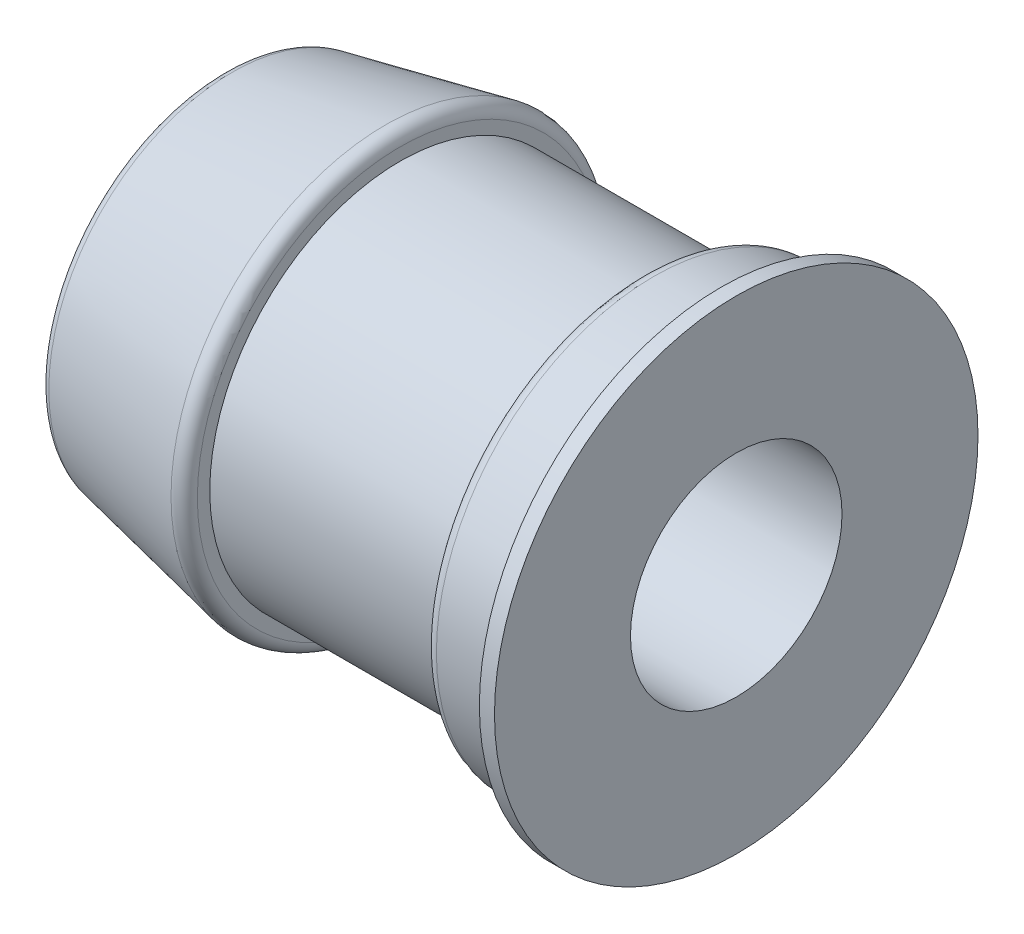
ISO-10303-21;
HEADER;
FILE_DESCRIPTION(('STEP AP214'),'2;1');
FILE_NAME('part.step','',(''),(''),'','','');
FILE_SCHEMA(('AUTOMOTIVE_DESIGN { 1 0 10303 214 1 1 1 1 }'));
ENDSEC;
DATA;
#1=APPLICATION_CONTEXT('core data for automotive mechanical design processes');
#2=APPLICATION_PROTOCOL_DEFINITION('international standard','automotive_design',2000,#1);
#3=PRODUCT_CONTEXT('',#1,'mechanical');
#4=PRODUCT('Part','Part','',(#3));
#5=PRODUCT_RELATED_PRODUCT_CATEGORY('part','',(#4));
#6=PRODUCT_DEFINITION_FORMATION('','',#4);
#7=PRODUCT_DEFINITION_CONTEXT('part definition',#1,'design');
#8=PRODUCT_DEFINITION('design','',#6,#7);
#9=PRODUCT_DEFINITION_SHAPE('','',#8);
#10=(LENGTH_UNIT() NAMED_UNIT(*) SI_UNIT(.MILLI.,.METRE.));
#11=(NAMED_UNIT(*) PLANE_ANGLE_UNIT() SI_UNIT($,.RADIAN.));
#12=(NAMED_UNIT(*) SI_UNIT($,.STERADIAN.) SOLID_ANGLE_UNIT());
#13=UNCERTAINTY_MEASURE_WITH_UNIT(LENGTH_MEASURE(1.E-05),#10,'distance_accuracy_value','');
#14=(GEOMETRIC_REPRESENTATION_CONTEXT(3) GLOBAL_UNCERTAINTY_ASSIGNED_CONTEXT((#13)) GLOBAL_UNIT_ASSIGNED_CONTEXT((#10,
#11,#12)) REPRESENTATION_CONTEXT('',''));
#15=CARTESIAN_POINT('',(0.,0.,0.));
#16=DIRECTION('',(0.,0.,1.));
#17=DIRECTION('',(1.,0.,0.));
#18=AXIS2_PLACEMENT_3D('',#15,#16,#17);
#19=CARTESIAN_POINT('',(0.,15.875,0.));
#20=DIRECTION('',(1.,0.,0.));
#21=DIRECTION('',(0.,0.,-1.));
#22=AXIS2_PLACEMENT_3D('',#19,#20,#21);
#23=PLANE('',#22);
#24=CARTESIAN_POINT('',(0.,0.,0.));
#25=DIRECTION('',(-1.,0.,0.));
#26=DIRECTION('',(0.,0.,1.));
#27=AXIS2_PLACEMENT_3D('',#24,#25,#26);
#28=CIRCLE('',#27,11.1125);
#29=CARTESIAN_POINT('',(0.,0.,11.1125));
#30=VERTEX_POINT('',#29);
#31=EDGE_CURVE('E60',#30,#30,#28,.T.);
#32=ORIENTED_EDGE('',*,*,#31,.F.);
#33=EDGE_LOOP('',(#32));
#34=FACE_BOUND('',#33,.T.);
#35=CARTESIAN_POINT('',(0.,0.,0.));
#36=DIRECTION('',(-1.,0.,0.));
#37=DIRECTION('',(0.,0.,1.));
#38=AXIS2_PLACEMENT_3D('',#35,#36,#37);
#39=CIRCLE('',#38,15.875);
#40=CARTESIAN_POINT('',(0.,0.,15.875));
#41=VERTEX_POINT('',#40);
#42=EDGE_CURVE('E84',#41,#41,#39,.T.);
#43=ORIENTED_EDGE('',*,*,#42,.T.);
#44=EDGE_LOOP('',(#43));
#45=FACE_BOUND('',#44,.T.);
#46=ADVANCED_FACE('F34',(#34,#45),#23,.F.);
#47=CARTESIAN_POINT('',(-42.2010183631773,0.,0.));
#48=DIRECTION('',(-1.,0.,0.));
#49=DIRECTION('',(0.,0.,1.));
#50=AXIS2_PLACEMENT_3D('',#47,#48,#49);
#51=CYLINDRICAL_SURFACE('',#50,11.1125);
#52=CARTESIAN_POINT('',(22.6123864777647,0.,0.));
#53=DIRECTION('',(-1.,0.,0.));
#54=DIRECTION('',(0.,0.,1.));
#55=AXIS2_PLACEMENT_3D('',#52,#53,#54);
#56=CIRCLE('',#55,11.1125);
#57=CARTESIAN_POINT('',(22.6123864777647,0.,11.1125));
#58=VERTEX_POINT('',#57);
#59=EDGE_CURVE('E63',#58,#58,#56,.T.);
#60=ORIENTED_EDGE('',*,*,#59,.F.);
#61=EDGE_LOOP('',(#60));
#62=FACE_BOUND('',#61,.T.);
#63=ORIENTED_EDGE('',*,*,#31,.T.);
#64=EDGE_LOOP('',(#63));
#65=FACE_BOUND('',#64,.T.);
#66=ADVANCED_FACE('F107',(#62,#65),#51,.F.);
#67=CARTESIAN_POINT('',(22.6123864777648,25.4,0.));
#68=DIRECTION('',(-1.,0.,0.));
#69=DIRECTION('',(0.,0.,1.));
#70=AXIS2_PLACEMENT_3D('',#67,#68,#69);
#71=PLANE('',#70);
#72=CARTESIAN_POINT('',(22.6123864777647,0.,0.));
#73=DIRECTION('',(-1.,0.,0.));
#74=DIRECTION('',(0.,0.,1.));
#75=AXIS2_PLACEMENT_3D('',#72,#73,#74);
#76=CIRCLE('',#75,25.4);
#77=CARTESIAN_POINT('',(22.6123864777647,0.,25.4));
#78=VERTEX_POINT('',#77);
#79=EDGE_CURVE('E66',#78,#78,#76,.T.);
#80=ORIENTED_EDGE('',*,*,#79,.F.);
#81=EDGE_LOOP('',(#80));
#82=FACE_BOUND('',#81,.T.);
#83=ORIENTED_EDGE('',*,*,#59,.T.);
#84=EDGE_LOOP('',(#83));
#85=FACE_BOUND('',#84,.T.);
#86=ADVANCED_FACE('F113',(#82,#85),#71,.F.);
#87=CARTESIAN_POINT('',(-42.2010183631773,0.,0.));
#88=DIRECTION('',(-1.,0.,0.));
#89=DIRECTION('',(0.,0.,1.));
#90=AXIS2_PLACEMENT_3D('',#87,#88,#89);
#91=CYLINDRICAL_SURFACE('',#90,25.4);
#92=CARTESIAN_POINT('',(21.0248864777648,0.,0.));
#93=DIRECTION('',(-1.,0.,0.));
#94=DIRECTION('',(0.,0.,1.));
#95=AXIS2_PLACEMENT_3D('',#92,#93,#94);
#96=CIRCLE('',#95,25.4);
#97=CARTESIAN_POINT('',(21.0248864777648,0.,25.4));
#98=VERTEX_POINT('',#97);
#99=EDGE_CURVE('E69',#98,#98,#96,.T.);
#100=ORIENTED_EDGE('',*,*,#99,.F.);
#101=EDGE_LOOP('',(#100));
#102=FACE_BOUND('',#101,.T.);
#103=ORIENTED_EDGE('',*,*,#79,.T.);
#104=EDGE_LOOP('',(#103));
#105=FACE_BOUND('',#104,.T.);
#106=ADVANCED_FACE('F209',(#102,#105),#91,.T.);
#107=CARTESIAN_POINT('',(21.0248864777648,0.,0.));
#108=DIRECTION('',(1.,0.,0.));
#109=DIRECTION('',(0.,0.,-1.));
#110=AXIS2_PLACEMENT_3D('',#107,#108,#109);
#111=CONICAL_SURFACE('',#110,25.4,1.0471975511966);
#112=CARTESIAN_POINT('',(19.5584167940231,0.,0.));
#113=DIRECTION('',(-1.,0.,0.));
#114=DIRECTION('',(0.,0.,1.));
#115=AXIS2_PLACEMENT_3D('',#112,#113,#114);
#116=CIRCLE('',#115,22.86);
#117=CARTESIAN_POINT('',(19.5584167940231,0.,22.86));
#118=VERTEX_POINT('',#117);
#119=EDGE_CURVE('E72',#118,#118,#116,.T.);
#120=ORIENTED_EDGE('',*,*,#119,.F.);
#121=EDGE_LOOP('',(#120));
#122=FACE_BOUND('',#121,.T.);
#123=ORIENTED_EDGE('',*,*,#99,.T.);
#124=EDGE_LOOP('',(#123));
#125=FACE_BOUND('',#124,.T.);
#126=ADVANCED_FACE('F187',(#122,#125),#111,.T.);
#127=CARTESIAN_POINT('',(-42.2010183631773,0.,0.));
#128=DIRECTION('',(-1.,0.,0.));
#129=DIRECTION('',(0.,0.,1.));
#130=AXIS2_PLACEMENT_3D('',#127,#128,#129);
#131=CYLINDRICAL_SURFACE('',#130,22.86);
#132=CARTESIAN_POINT('',(13.97,0.,0.));
#133=DIRECTION('',(1.,0.,0.));
#134=DIRECTION('',(0.,0.,-1.));
#135=AXIS2_PLACEMENT_3D('',#132,#133,#134);
#136=CIRCLE('',#135,22.86);
#137=CARTESIAN_POINT('',(13.97,0.,-22.86));
#138=VERTEX_POINT('',#137);
#139=EDGE_CURVE('E54',#138,#138,#136,.T.);
#140=ORIENTED_EDGE('',*,*,#139,.T.);
#141=EDGE_LOOP('',(#140));
#142=FACE_BOUND('',#141,.T.);
#143=ORIENTED_EDGE('',*,*,#119,.T.);
#144=EDGE_LOOP('',(#143));
#145=FACE_BOUND('',#144,.T.);
#146=ADVANCED_FACE('F177',(#142,#145),#131,.T.);
#147=CARTESIAN_POINT('',(12.7,20.,0.));
#148=DIRECTION('',(1.,0.,0.));
#149=DIRECTION('',(0.,0.,-1.));
#150=AXIS2_PLACEMENT_3D('',#147,#148,#149);
#151=PLANE('',#150);
#152=CARTESIAN_POINT('',(12.7,0.,0.));
#153=DIRECTION('',(1.,0.,0.));
#154=DIRECTION('',(0.,0.,-1.));
#155=AXIS2_PLACEMENT_3D('',#152,#153,#154);
#156=CIRCLE('',#155,21.59);
#157=CARTESIAN_POINT('',(12.7,0.,-21.59));
#158=VERTEX_POINT('',#157);
#159=EDGE_CURVE('E57',#158,#158,#156,.F.);
#160=ORIENTED_EDGE('',*,*,#159,.T.);
#161=EDGE_LOOP('',(#160));
#162=FACE_BOUND('',#161,.T.);
#163=CARTESIAN_POINT('',(12.7,0.,0.));
#164=DIRECTION('',(-1.,0.,0.));
#165=DIRECTION('',(0.,0.,1.));
#166=AXIS2_PLACEMENT_3D('',#163,#164,#165);
#167=CIRCLE('',#166,20.);
#168=CARTESIAN_POINT('',(12.7,0.,20.));
#169=VERTEX_POINT('',#168);
#170=EDGE_CURVE('E75',#169,#169,#167,.T.);
#171=ORIENTED_EDGE('',*,*,#170,.F.);
#172=EDGE_LOOP('',(#171));
#173=FACE_BOUND('',#172,.T.);
#174=ADVANCED_FACE('F172',(#162,#173),#151,.F.);
#175=CARTESIAN_POINT('',(-42.2010183631773,0.,0.));
#176=DIRECTION('',(-1.,0.,0.));
#177=DIRECTION('',(0.,0.,1.));
#178=AXIS2_PLACEMENT_3D('',#175,#176,#177);
#179=CYLINDRICAL_SURFACE('',#178,20.);
#180=CARTESIAN_POINT('',(-12.7,0.,0.));
#181=DIRECTION('',(-1.,0.,0.));
#182=DIRECTION('',(0.,0.,1.));
#183=AXIS2_PLACEMENT_3D('',#180,#181,#182);
#184=CIRCLE('',#183,20.);
#185=CARTESIAN_POINT('',(-12.7,0.,20.));
#186=VERTEX_POINT('',#185);
#187=EDGE_CURVE('E78',#186,#186,#184,.T.);
#188=ORIENTED_EDGE('',*,*,#187,.F.);
#189=EDGE_LOOP('',(#188));
#190=FACE_BOUND('',#189,.T.);
#191=ORIENTED_EDGE('',*,*,#170,.T.);
#192=EDGE_LOOP('',(#191));
#193=FACE_BOUND('',#192,.T.);
#194=ADVANCED_FACE('F165',(#190,#193),#179,.T.);
#195=CARTESIAN_POINT('',(-12.7,22.86,0.));
#196=DIRECTION('',(-1.,0.,0.));
#197=DIRECTION('',(0.,0.,1.));
#198=AXIS2_PLACEMENT_3D('',#195,#196,#197);
#199=PLANE('',#198);
#200=CARTESIAN_POINT('',(-12.7,0.,0.));
#201=DIRECTION('',(-1.,0.,0.));
#202=DIRECTION('',(0.,0.,1.));
#203=AXIS2_PLACEMENT_3D('',#200,#201,#202);
#204=CIRCLE('',#203,21.3046593494137);
#205=CARTESIAN_POINT('',(-12.7,0.,21.3046593494137));
#206=VERTEX_POINT('',#205);
#207=EDGE_CURVE('E41',#206,#206,#204,.F.);
#208=ORIENTED_EDGE('',*,*,#207,.T.);
#209=EDGE_LOOP('',(#208));
#210=FACE_BOUND('',#209,.T.);
#211=ORIENTED_EDGE('',*,*,#187,.T.);
#212=EDGE_LOOP('',(#211));
#213=FACE_BOUND('',#212,.T.);
#214=ADVANCED_FACE('F103',(#210,#213),#199,.F.);
#215=CARTESIAN_POINT('',(-12.7,0.,0.));
#216=DIRECTION('',(1.,0.,0.));
#217=DIRECTION('',(0.,0.,-1.));
#218=AXIS2_PLACEMENT_3D('',#215,#216,#217);
#219=CONICAL_SURFACE('',#218,22.86,0.201304164009121);
#220=CARTESIAN_POINT('',(-14.2239331078775,0.,0.));
#221=DIRECTION('',(-1.,0.,0.));
#222=DIRECTION('',(0.,0.,1.));
#223=AXIS2_PLACEMENT_3D('',#220,#221,#222);
#224=CIRCLE('',#223,22.549013791172);
#225=CARTESIAN_POINT('',(-14.2239331078775,0.,22.549013791172));
#226=VERTEX_POINT('',#225);
#227=EDGE_CURVE('E45',#226,#226,#224,.T.);
#228=ORIENTED_EDGE('',*,*,#227,.T.);
#229=EDGE_LOOP('',(#228));
#230=FACE_BOUND('',#229,.T.);
#231=CARTESIAN_POINT('',(-30.3541666301127,0.,0.));
#232=DIRECTION('',(-1.,0.,0.));
#233=DIRECTION('',(0.,0.,1.));
#234=AXIS2_PLACEMENT_3D('',#231,#232,#233);
#235=CIRCLE('',#234,19.2573468901381);
#236=CARTESIAN_POINT('',(-30.3541666301127,0.,19.2573468901381));
#237=VERTEX_POINT('',#236);
#238=EDGE_CURVE('E49',#237,#237,#235,.F.);
#239=ORIENTED_EDGE('',*,*,#238,.T.);
#240=EDGE_LOOP('',(#239));
#241=FACE_BOUND('',#240,.T.);
#242=ADVANCED_FACE('F98',(#230,#241),#219,.T.);
#243=CARTESIAN_POINT('',(-31.3702335222353,19.05,0.));
#244=DIRECTION('',(1.,0.,0.));
#245=DIRECTION('',(0.,0.,-1.));
#246=AXIS2_PLACEMENT_3D('',#243,#244,#245);
#247=PLANE('',#246);
#248=CARTESIAN_POINT('',(-31.3702335222353,0.,0.));
#249=DIRECTION('',(1.,0.,0.));
#250=DIRECTION('',(0.,0.,-1.));
#251=AXIS2_PLACEMENT_3D('',#248,#249,#250);
#252=CIRCLE('',#251,18.0129924483797);
#253=CARTESIAN_POINT('',(-31.3702335222353,0.,-18.0129924483797));
#254=VERTEX_POINT('',#253);
#255=EDGE_CURVE('E10',#254,#254,#252,.F.);
#256=ORIENTED_EDGE('',*,*,#255,.T.);
#257=EDGE_LOOP('',(#256));
#258=FACE_BOUND('',#257,.T.);
#259=CARTESIAN_POINT('',(-31.3702335222353,0.,0.));
#260=DIRECTION('',(-1.,0.,0.));
#261=DIRECTION('',(0.,0.,1.));
#262=AXIS2_PLACEMENT_3D('',#259,#260,#261);
#263=CIRCLE('',#262,15.875);
#264=CARTESIAN_POINT('',(-31.3702335222353,0.,15.875));
#265=VERTEX_POINT('',#264);
#266=EDGE_CURVE('E81',#265,#265,#263,.T.);
#267=ORIENTED_EDGE('',*,*,#266,.F.);
#268=EDGE_LOOP('',(#267));
#269=FACE_BOUND('',#268,.T.);
#270=ADVANCED_FACE('F93',(#258,#269),#247,.F.);
#271=CARTESIAN_POINT('',(-42.2010183631773,0.,0.));
#272=DIRECTION('',(-1.,0.,0.));
#273=DIRECTION('',(0.,0.,1.));
#274=AXIS2_PLACEMENT_3D('',#271,#272,#273);
#275=CYLINDRICAL_SURFACE('',#274,15.875);
#276=ORIENTED_EDGE('',*,*,#42,.F.);
#277=EDGE_LOOP('',(#276));
#278=FACE_BOUND('',#277,.T.);
#279=ORIENTED_EDGE('',*,*,#266,.T.);
#280=EDGE_LOOP('',(#279));
#281=FACE_BOUND('',#280,.T.);
#282=ADVANCED_FACE('F89',(#278,#281),#275,.F.);
#283=CARTESIAN_POINT('',(13.97,0.,0.));
#284=DIRECTION('',(1.,0.,0.));
#285=DIRECTION('',(0.,0.,-1.));
#286=AXIS2_PLACEMENT_3D('',#283,#284,#285);
#287=TOROIDAL_SURFACE('',#286,21.59,1.27);
#288=ORIENTED_EDGE('',*,*,#139,.F.);
#289=EDGE_LOOP('',(#288));
#290=FACE_BOUND('',#289,.T.);
#291=ORIENTED_EDGE('',*,*,#159,.F.);
#292=EDGE_LOOP('',(#291));
#293=FACE_BOUND('',#292,.T.);
#294=ADVANCED_FACE('F92',(#290,#293),#287,.T.);
#295=CARTESIAN_POINT('',(-13.97,0.,0.));
#296=DIRECTION('',(-1.,0.,0.));
#297=DIRECTION('',(0.,0.,1.));
#298=AXIS2_PLACEMENT_3D('',#295,#296,#297);
#299=TOROIDAL_SURFACE('',#298,21.3046593494137,1.27);
#300=ORIENTED_EDGE('',*,*,#207,.F.);
#301=EDGE_LOOP('',(#300));
#302=FACE_BOUND('',#301,.T.);
#303=ORIENTED_EDGE('',*,*,#227,.F.);
#304=EDGE_LOOP('',(#303));
#305=FACE_BOUND('',#304,.T.);
#306=ADVANCED_FACE('F120',(#302,#305),#299,.T.);
#307=CARTESIAN_POINT('',(-30.1002335222353,0.,0.));
#308=DIRECTION('',(1.,0.,0.));
#309=DIRECTION('',(0.,0.,-1.));
#310=AXIS2_PLACEMENT_3D('',#307,#308,#309);
#311=TOROIDAL_SURFACE('',#310,18.0129924483797,1.27);
#312=ORIENTED_EDGE('',*,*,#238,.F.);
#313=EDGE_LOOP('',(#312));
#314=FACE_BOUND('',#313,.T.);
#315=ORIENTED_EDGE('',*,*,#255,.F.);
#316=EDGE_LOOP('',(#315));
#317=FACE_BOUND('',#316,.T.);
#318=ADVANCED_FACE('F36',(#314,#317),#311,.T.);
#319=CLOSED_SHELL('',(#46,#66,#86,#106,#126,#146,#174,#194,#214,#242,#270,#282,#294,#306,#318));
#320=MANIFOLD_SOLID_BREP('B2',#319);
#321=ADVANCED_BREP_SHAPE_REPRESENTATION('',(#18,#320),#14);
#322=SHAPE_DEFINITION_REPRESENTATION(#9,#321);
ENDSEC;
END-ISO-10303-21;
